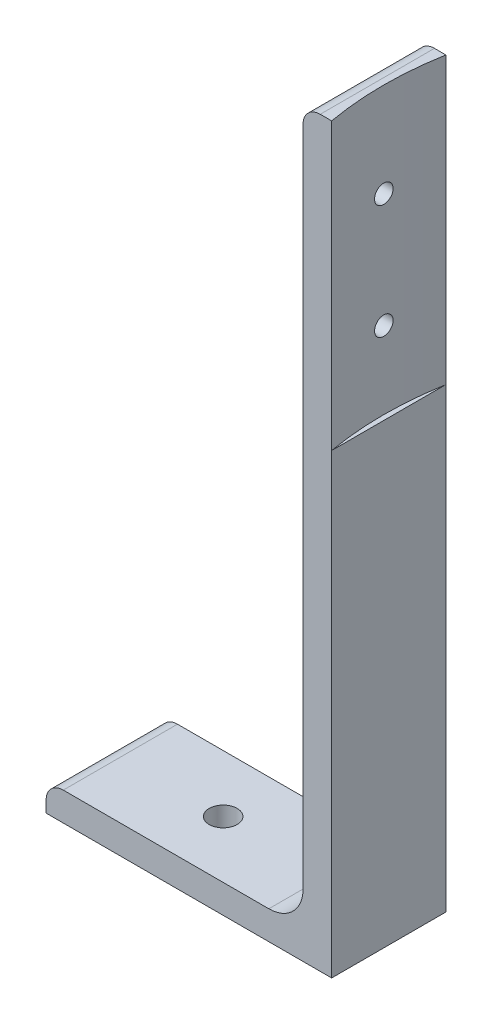
ISO-10303-21;
HEADER;
FILE_DESCRIPTION(('STEP AP214'),'2;1');
FILE_NAME('part.step','',(''),(''),'','','');
FILE_SCHEMA(('AUTOMOTIVE_DESIGN { 1 0 10303 214 1 1 1 1 }'));
ENDSEC;
DATA;
#1=APPLICATION_CONTEXT('core data for automotive mechanical design processes');
#2=APPLICATION_PROTOCOL_DEFINITION('international standard','automotive_design',2000,#1);
#3=PRODUCT_CONTEXT('',#1,'mechanical');
#4=PRODUCT('Part','Part','',(#3));
#5=PRODUCT_RELATED_PRODUCT_CATEGORY('part','',(#4));
#6=PRODUCT_DEFINITION_FORMATION('','',#4);
#7=PRODUCT_DEFINITION_CONTEXT('part definition',#1,'design');
#8=PRODUCT_DEFINITION('design','',#6,#7);
#9=PRODUCT_DEFINITION_SHAPE('','',#8);
#10=(LENGTH_UNIT() NAMED_UNIT(*) SI_UNIT(.MILLI.,.METRE.));
#11=(NAMED_UNIT(*) PLANE_ANGLE_UNIT() SI_UNIT($,.RADIAN.));
#12=(NAMED_UNIT(*) SI_UNIT($,.STERADIAN.) SOLID_ANGLE_UNIT());
#13=UNCERTAINTY_MEASURE_WITH_UNIT(LENGTH_MEASURE(1.E-05),#10,'distance_accuracy_value','');
#14=(GEOMETRIC_REPRESENTATION_CONTEXT(3) GLOBAL_UNCERTAINTY_ASSIGNED_CONTEXT((#13)) GLOBAL_UNIT_ASSIGNED_CONTEXT((#10,
#11,#12)) REPRESENTATION_CONTEXT('',''));
#15=CARTESIAN_POINT('',(0.,0.,0.));
#16=DIRECTION('',(0.,0.,1.));
#17=DIRECTION('',(1.,0.,0.));
#18=AXIS2_PLACEMENT_3D('',#15,#16,#17);
#19=CARTESIAN_POINT('',(0.,0.,10.));
#20=DIRECTION('',(-1.,0.,0.));
#21=DIRECTION('',(0.,0.,1.));
#22=AXIS2_PLACEMENT_3D('',#19,#20,#21);
#23=PLANE('',#22);
#24=DIRECTION('',(0.,0.,-1.));
#25=VECTOR('',#24,1.);
#26=CARTESIAN_POINT('',(0.,80.,0.));
#27=LINE('',#26,#25);
#28=CARTESIAN_POINT('',(0.,80.,10.));
#29=VERTEX_POINT('',#28);
#30=CARTESIAN_POINT('',(0.,80.,-10.));
#31=VERTEX_POINT('',#30);
#32=EDGE_CURVE('E310',#29,#31,#27,.T.);
#33=ORIENTED_EDGE('',*,*,#32,.F.);
#34=DIRECTION('',(0.,1.,0.));
#35=VECTOR('',#34,1.);
#36=CARTESIAN_POINT('',(0.,0.,10.));
#37=LINE('',#36,#35);
#38=CARTESIAN_POINT('',(0.,0.,10.));
#39=VERTEX_POINT('',#38);
#40=EDGE_CURVE('E158',#39,#29,#37,.T.);
#41=ORIENTED_EDGE('',*,*,#40,.F.);
#42=DIRECTION('',(0.,0.,-1.));
#43=VECTOR('',#42,1.);
#44=CARTESIAN_POINT('',(0.,0.,10.));
#45=LINE('',#44,#43);
#46=CARTESIAN_POINT('',(0.,0.,-10.));
#47=VERTEX_POINT('',#46);
#48=EDGE_CURVE('E152',#39,#47,#45,.T.);
#49=ORIENTED_EDGE('',*,*,#48,.T.);
#50=DIRECTION('',(0.,1.,0.));
#51=VECTOR('',#50,1.);
#52=CARTESIAN_POINT('',(0.,0.,-10.));
#53=LINE('',#52,#51);
#54=EDGE_CURVE('E189',#47,#31,#53,.T.);
#55=ORIENTED_EDGE('',*,*,#54,.T.);
#56=EDGE_LOOP('',(#33,#41,#49,#55));
#57=FACE_BOUND('',#56,.T.);
#58=ADVANCED_FACE('F39',(#57),#23,.F.);
#59=CARTESIAN_POINT('',(-2.,127.,10.));
#60=DIRECTION('',(0.,0.,-1.));
#61=DIRECTION('',(-1.,0.,0.));
#62=AXIS2_PLACEMENT_3D('',#59,#60,#61);
#63=CYLINDRICAL_SURFACE('',#62,3.);
#64=CARTESIAN_POINT('',(-2.,127.,-10.));
#65=DIRECTION('',(0.,0.,1.));
#66=DIRECTION('',(1.,0.,0.));
#67=AXIS2_PLACEMENT_3D('',#64,#65,#66);
#68=CIRCLE('',#67,3.);
#69=CARTESIAN_POINT('',(-2.,130.,-10.));
#70=VERTEX_POINT('',#69);
#71=CARTESIAN_POINT('',(-5.,127.,-10.));
#72=VERTEX_POINT('',#71);
#73=EDGE_CURVE('E167',#70,#72,#68,.T.);
#74=ORIENTED_EDGE('',*,*,#73,.T.);
#75=DIRECTION('',(0.,0.,-1.));
#76=VECTOR('',#75,1.);
#77=CARTESIAN_POINT('',(-5.,127.,10.));
#78=LINE('',#77,#76);
#79=CARTESIAN_POINT('',(-5.,127.,10.));
#80=VERTEX_POINT('',#79);
#81=EDGE_CURVE('E11',#80,#72,#78,.T.);
#82=ORIENTED_EDGE('',*,*,#81,.F.);
#83=CARTESIAN_POINT('',(-2.,127.,10.));
#84=DIRECTION('',(0.,0.,1.));
#85=DIRECTION('',(1.,0.,0.));
#86=AXIS2_PLACEMENT_3D('',#83,#84,#85);
#87=CIRCLE('',#86,3.);
#88=CARTESIAN_POINT('',(-2.,130.,10.));
#89=VERTEX_POINT('',#88);
#90=EDGE_CURVE('E195',#89,#80,#87,.T.);
#91=ORIENTED_EDGE('',*,*,#90,.F.);
#92=DIRECTION('',(0.,0.,-1.));
#93=VECTOR('',#92,1.);
#94=CARTESIAN_POINT('',(-2.,130.,10.));
#95=LINE('',#94,#93);
#96=EDGE_CURVE('E166',#89,#70,#95,.T.);
#97=ORIENTED_EDGE('',*,*,#96,.T.);
#98=EDGE_LOOP('',(#74,#82,#91,#97));
#99=FACE_BOUND('',#98,.T.);
#100=ADVANCED_FACE('F41',(#99),#63,.T.);
#101=CARTESIAN_POINT('',(-5.,127.,10.));
#102=DIRECTION('',(1.,0.,0.));
#103=DIRECTION('',(0.,1.,0.));
#104=AXIS2_PLACEMENT_3D('',#101,#102,#103);
#105=PLANE('',#104);
#106=CARTESIAN_POINT('',(-4.99999999999999,93.5,0.));
#107=DIRECTION('',(-1.,0.,0.));
#108=DIRECTION('',(0.,-1.,0.));
#109=AXIS2_PLACEMENT_3D('',#106,#107,#108);
#110=CIRCLE('',#109,1.625);
#111=CARTESIAN_POINT('',(-4.99999999999999,91.875,0.));
#112=VERTEX_POINT('',#111);
#113=EDGE_CURVE('E219',#112,#112,#110,.T.);
#114=ORIENTED_EDGE('',*,*,#113,.F.);
#115=EDGE_LOOP('',(#114));
#116=FACE_BOUND('',#115,.T.);
#117=CARTESIAN_POINT('',(-5.,113.5,0.));
#118=DIRECTION('',(-1.,0.,0.));
#119=DIRECTION('',(0.,-1.,0.));
#120=AXIS2_PLACEMENT_3D('',#117,#118,#119);
#121=CIRCLE('',#120,1.625);
#122=CARTESIAN_POINT('',(-5.,111.875,0.));
#123=VERTEX_POINT('',#122);
#124=EDGE_CURVE('E277',#123,#123,#121,.T.);
#125=ORIENTED_EDGE('',*,*,#124,.F.);
#126=EDGE_LOOP('',(#125));
#127=FACE_BOUND('',#126,.T.);
#128=DIRECTION('',(0.,-1.,0.));
#129=VECTOR('',#128,1.);
#130=CARTESIAN_POINT('',(-5.,127.,-10.));
#131=LINE('',#130,#129);
#132=CARTESIAN_POINT('',(-4.99999999999999,11.,-10.));
#133=VERTEX_POINT('',#132);
#134=EDGE_CURVE('E171',#72,#133,#131,.T.);
#135=ORIENTED_EDGE('',*,*,#134,.T.);
#136=DIRECTION('',(0.,0.,-1.));
#137=VECTOR('',#136,1.);
#138=CARTESIAN_POINT('',(-4.99999999999999,11.,10.));
#139=LINE('',#138,#137);
#140=CARTESIAN_POINT('',(-4.99999999999999,11.,10.));
#141=VERTEX_POINT('',#140);
#142=EDGE_CURVE('E54',#141,#133,#139,.T.);
#143=ORIENTED_EDGE('',*,*,#142,.F.);
#144=DIRECTION('',(0.,-1.,0.));
#145=VECTOR('',#144,1.);
#146=CARTESIAN_POINT('',(-5.,127.,10.));
#147=LINE('',#146,#145);
#148=EDGE_CURVE('E113',#80,#141,#147,.T.);
#149=ORIENTED_EDGE('',*,*,#148,.F.);
#150=ORIENTED_EDGE('',*,*,#81,.T.);
#151=EDGE_LOOP('',(#135,#143,#149,#150));
#152=FACE_BOUND('',#151,.T.);
#153=ADVANCED_FACE('F245',(#116,#127,#152),#105,.F.);
#154=CARTESIAN_POINT('',(-11.,11.,10.));
#155=DIRECTION('',(0.,0.,-1.));
#156=DIRECTION('',(-1.,0.,0.));
#157=AXIS2_PLACEMENT_3D('',#154,#155,#156);
#158=CYLINDRICAL_SURFACE('',#157,6.);
#159=CARTESIAN_POINT('',(-11.,11.,-10.));
#160=DIRECTION('',(0.,0.,-1.));
#161=DIRECTION('',(-1.,0.,0.));
#162=AXIS2_PLACEMENT_3D('',#159,#160,#161);
#163=CIRCLE('',#162,6.);
#164=CARTESIAN_POINT('',(-11.,5.,-10.));
#165=VERTEX_POINT('',#164);
#166=EDGE_CURVE('E175',#133,#165,#163,.T.);
#167=ORIENTED_EDGE('',*,*,#166,.T.);
#168=DIRECTION('',(0.,0.,-1.));
#169=VECTOR('',#168,1.);
#170=CARTESIAN_POINT('',(-11.,5.,10.));
#171=LINE('',#170,#169);
#172=CARTESIAN_POINT('',(-11.,5.,10.));
#173=VERTEX_POINT('',#172);
#174=EDGE_CURVE('E206',#173,#165,#171,.T.);
#175=ORIENTED_EDGE('',*,*,#174,.F.);
#176=CARTESIAN_POINT('',(-11.,11.,10.));
#177=DIRECTION('',(0.,0.,-1.));
#178=DIRECTION('',(-1.,0.,0.));
#179=AXIS2_PLACEMENT_3D('',#176,#177,#178);
#180=CIRCLE('',#179,6.);
#181=EDGE_CURVE('E284',#141,#173,#180,.T.);
#182=ORIENTED_EDGE('',*,*,#181,.F.);
#183=ORIENTED_EDGE('',*,*,#142,.T.);
#184=EDGE_LOOP('',(#167,#175,#182,#183));
#185=FACE_BOUND('',#184,.T.);
#186=ADVANCED_FACE('F264',(#185),#158,.F.);
#187=CARTESIAN_POINT('',(-11.,5.,10.));
#188=DIRECTION('',(0.,-1.,0.));
#189=DIRECTION('',(1.,0.,0.));
#190=AXIS2_PLACEMENT_3D('',#187,#188,#189);
#191=PLANE('',#190);
#192=CARTESIAN_POINT('',(-29.,5.,0.));
#193=DIRECTION('',(0.,1.,0.));
#194=DIRECTION('',(-1.,0.,0.));
#195=AXIS2_PLACEMENT_3D('',#192,#193,#194);
#196=CIRCLE('',#195,2.45);
#197=CARTESIAN_POINT('',(-31.45,5.,0.));
#198=VERTEX_POINT('',#197);
#199=EDGE_CURVE('E320',#198,#198,#196,.T.);
#200=ORIENTED_EDGE('',*,*,#199,.F.);
#201=EDGE_LOOP('',(#200));
#202=FACE_BOUND('',#201,.T.);
#203=DIRECTION('',(-1.,0.,0.));
#204=VECTOR('',#203,1.);
#205=CARTESIAN_POINT('',(-11.,5.,-10.));
#206=LINE('',#205,#204);
#207=CARTESIAN_POINT('',(-47.,5.,-10.));
#208=VERTEX_POINT('',#207);
#209=EDGE_CURVE('E178',#165,#208,#206,.T.);
#210=ORIENTED_EDGE('',*,*,#209,.T.);
#211=DIRECTION('',(0.,0.,-1.));
#212=VECTOR('',#211,1.);
#213=CARTESIAN_POINT('',(-47.,5.,10.));
#214=LINE('',#213,#212);
#215=CARTESIAN_POINT('',(-47.,5.,10.));
#216=VERTEX_POINT('',#215);
#217=EDGE_CURVE('E202',#216,#208,#214,.T.);
#218=ORIENTED_EDGE('',*,*,#217,.F.);
#219=DIRECTION('',(-1.,0.,0.));
#220=VECTOR('',#219,1.);
#221=CARTESIAN_POINT('',(-11.,5.,10.));
#222=LINE('',#221,#220);
#223=EDGE_CURVE('E291',#173,#216,#222,.T.);
#224=ORIENTED_EDGE('',*,*,#223,.F.);
#225=ORIENTED_EDGE('',*,*,#174,.T.);
#226=EDGE_LOOP('',(#210,#218,#224,#225));
#227=FACE_BOUND('',#226,.T.);
#228=ADVANCED_FACE('F260',(#202,#227),#191,.F.);
#229=CARTESIAN_POINT('',(-47.,1.99999999999999,10.));
#230=DIRECTION('',(0.,0.,-1.));
#231=DIRECTION('',(-1.,0.,0.));
#232=AXIS2_PLACEMENT_3D('',#229,#230,#231);
#233=CYLINDRICAL_SURFACE('',#232,3.);
#234=CARTESIAN_POINT('',(-47.,1.99999999999999,-10.));
#235=DIRECTION('',(0.,0.,1.));
#236=DIRECTION('',(1.,0.,0.));
#237=AXIS2_PLACEMENT_3D('',#234,#235,#236);
#238=CIRCLE('',#237,3.);
#239=CARTESIAN_POINT('',(-50.,1.99999999999999,-10.));
#240=VERTEX_POINT('',#239);
#241=EDGE_CURVE('E181',#208,#240,#238,.T.);
#242=ORIENTED_EDGE('',*,*,#241,.T.);
#243=DIRECTION('',(0.,0.,-1.));
#244=VECTOR('',#243,1.);
#245=CARTESIAN_POINT('',(-50.,1.99999999999999,10.));
#246=LINE('',#245,#244);
#247=CARTESIAN_POINT('',(-50.,1.99999999999999,10.));
#248=VERTEX_POINT('',#247);
#249=EDGE_CURVE('E151',#248,#240,#246,.T.);
#250=ORIENTED_EDGE('',*,*,#249,.F.);
#251=CARTESIAN_POINT('',(-47.,1.99999999999999,10.));
#252=DIRECTION('',(0.,0.,1.));
#253=DIRECTION('',(1.,0.,0.));
#254=AXIS2_PLACEMENT_3D('',#251,#252,#253);
#255=CIRCLE('',#254,3.);
#256=EDGE_CURVE('E137',#216,#248,#255,.T.);
#257=ORIENTED_EDGE('',*,*,#256,.F.);
#258=ORIENTED_EDGE('',*,*,#217,.T.);
#259=EDGE_LOOP('',(#242,#250,#257,#258));
#260=FACE_BOUND('',#259,.T.);
#261=ADVANCED_FACE('F257',(#260),#233,.T.);
#262=CARTESIAN_POINT('',(-50.,1.99999999999999,10.));
#263=DIRECTION('',(1.,0.,0.));
#264=DIRECTION('',(0.,0.,-1.));
#265=AXIS2_PLACEMENT_3D('',#262,#263,#264);
#266=PLANE('',#265);
#267=DIRECTION('',(0.,-1.,0.));
#268=VECTOR('',#267,1.);
#269=CARTESIAN_POINT('',(-50.,1.99999999999999,-10.));
#270=LINE('',#269,#268);
#271=CARTESIAN_POINT('',(-50.,0.,-10.));
#272=VERTEX_POINT('',#271);
#273=EDGE_CURVE('E147',#240,#272,#270,.T.);
#274=ORIENTED_EDGE('',*,*,#273,.T.);
#275=DIRECTION('',(0.,0.,-1.));
#276=VECTOR('',#275,1.);
#277=CARTESIAN_POINT('',(-50.,0.,10.));
#278=LINE('',#277,#276);
#279=CARTESIAN_POINT('',(-50.,0.,10.));
#280=VERTEX_POINT('',#279);
#281=EDGE_CURVE('E144',#280,#272,#278,.T.);
#282=ORIENTED_EDGE('',*,*,#281,.F.);
#283=DIRECTION('',(0.,-1.,0.));
#284=VECTOR('',#283,1.);
#285=CARTESIAN_POINT('',(-50.,1.99999999999999,10.));
#286=LINE('',#285,#284);
#287=EDGE_CURVE('E129',#248,#280,#286,.T.);
#288=ORIENTED_EDGE('',*,*,#287,.F.);
#289=ORIENTED_EDGE('',*,*,#249,.T.);
#290=EDGE_LOOP('',(#274,#282,#288,#289));
#291=FACE_BOUND('',#290,.T.);
#292=ADVANCED_FACE('F145',(#291),#266,.F.);
#293=CARTESIAN_POINT('',(0.,0.,10.));
#294=DIRECTION('',(0.,1.,0.));
#295=DIRECTION('',(-1.,0.,0.));
#296=AXIS2_PLACEMENT_3D('',#293,#294,#295);
#297=PLANE('',#296);
#298=CARTESIAN_POINT('',(-29.,0.,0.));
#299=DIRECTION('',(0.,1.,0.));
#300=DIRECTION('',(-1.,0.,0.));
#301=AXIS2_PLACEMENT_3D('',#298,#299,#300);
#302=CIRCLE('',#301,2.45);
#303=CARTESIAN_POINT('',(-31.45,0.,0.));
#304=VERTEX_POINT('',#303);
#305=EDGE_CURVE('E317',#304,#304,#302,.T.);
#306=ORIENTED_EDGE('',*,*,#305,.T.);
#307=EDGE_LOOP('',(#306));
#308=FACE_BOUND('',#307,.T.);
#309=DIRECTION('',(1.,0.,0.));
#310=VECTOR('',#309,1.);
#311=CARTESIAN_POINT('',(0.,0.,-10.));
#312=LINE('',#311,#310);
#313=EDGE_CURVE('E186',#272,#47,#312,.T.);
#314=ORIENTED_EDGE('',*,*,#313,.T.);
#315=ORIENTED_EDGE('',*,*,#48,.F.);
#316=DIRECTION('',(1.,0.,0.));
#317=VECTOR('',#316,1.);
#318=CARTESIAN_POINT('',(0.,0.,10.));
#319=LINE('',#318,#317);
#320=EDGE_CURVE('E134',#280,#39,#319,.T.);
#321=ORIENTED_EDGE('',*,*,#320,.F.);
#322=ORIENTED_EDGE('',*,*,#281,.T.);
#323=EDGE_LOOP('',(#314,#315,#321,#322));
#324=FACE_BOUND('',#323,.T.);
#325=ADVANCED_FACE('F154',(#308,#324),#297,.F.);
#326=CARTESIAN_POINT('',(-2.,130.,10.));
#327=DIRECTION('',(0.,-1.,0.));
#328=DIRECTION('',(0.,0.,-1.));
#329=AXIS2_PLACEMENT_3D('',#326,#327,#328);
#330=PLANE('',#329);
#331=DIRECTION('',(-1.,0.,0.));
#332=VECTOR('',#331,1.);
#333=CARTESIAN_POINT('',(-2.,130.,10.));
#334=LINE('',#333,#332);
#335=CARTESIAN_POINT('',(0.,130.,10.));
#336=VERTEX_POINT('',#335);
#337=EDGE_CURVE('E71',#336,#89,#334,.T.);
#338=ORIENTED_EDGE('',*,*,#337,.F.);
#339=CARTESIAN_POINT('',(56.1159513863928,130.,0.));
#340=DIRECTION('',(0.,1.,0.));
#341=DIRECTION('',(0.,0.,1.));
#342=AXIS2_PLACEMENT_3D('',#339,#340,#341);
#343=CIRCLE('',#342,57.);
#344=CARTESIAN_POINT('',(0.,130.,-10.));
#345=VERTEX_POINT('',#344);
#346=EDGE_CURVE('E306',#345,#336,#343,.T.);
#347=ORIENTED_EDGE('',*,*,#346,.F.);
#348=DIRECTION('',(-1.,0.,0.));
#349=VECTOR('',#348,1.);
#350=CARTESIAN_POINT('',(-2.,130.,-10.));
#351=LINE('',#350,#349);
#352=EDGE_CURVE('E105',#345,#70,#351,.T.);
#353=ORIENTED_EDGE('',*,*,#352,.T.);
#354=ORIENTED_EDGE('',*,*,#96,.F.);
#355=EDGE_LOOP('',(#338,#347,#353,#354));
#356=FACE_BOUND('',#355,.T.);
#357=ADVANCED_FACE('F250',(#356),#330,.F.);
#358=CARTESIAN_POINT('',(-2.,127.,10.));
#359=DIRECTION('',(0.,0.,1.));
#360=DIRECTION('',(1.,0.,0.));
#361=AXIS2_PLACEMENT_3D('',#358,#359,#360);
#362=PLANE('',#361);
#363=ORIENTED_EDGE('',*,*,#90,.T.);
#364=ORIENTED_EDGE('',*,*,#148,.T.);
#365=ORIENTED_EDGE('',*,*,#181,.T.);
#366=ORIENTED_EDGE('',*,*,#223,.T.);
#367=ORIENTED_EDGE('',*,*,#256,.T.);
#368=ORIENTED_EDGE('',*,*,#287,.T.);
#369=ORIENTED_EDGE('',*,*,#320,.T.);
#370=ORIENTED_EDGE('',*,*,#40,.T.);
#371=DIRECTION('',(0.,1.,0.));
#372=VECTOR('',#371,1.);
#373=CARTESIAN_POINT('',(0.,80.,10.));
#374=LINE('',#373,#372);
#375=EDGE_CURVE('E172',#29,#336,#374,.T.);
#376=ORIENTED_EDGE('',*,*,#375,.T.);
#377=ORIENTED_EDGE('',*,*,#337,.T.);
#378=EDGE_LOOP('',(#363,#364,#365,#366,#367,#368,#369,#370,#376,#377));
#379=FACE_BOUND('',#378,.T.);
#380=ADVANCED_FACE('F131',(#379),#362,.T.);
#381=CARTESIAN_POINT('',(-2.,127.,-10.));
#382=DIRECTION('',(0.,0.,1.));
#383=DIRECTION('',(1.,0.,0.));
#384=AXIS2_PLACEMENT_3D('',#381,#382,#383);
#385=PLANE('',#384);
#386=ORIENTED_EDGE('',*,*,#73,.F.);
#387=ORIENTED_EDGE('',*,*,#352,.F.);
#388=DIRECTION('',(0.,1.,0.));
#389=VECTOR('',#388,1.);
#390=CARTESIAN_POINT('',(0.,80.,-10.));
#391=LINE('',#390,#389);
#392=EDGE_CURVE('E301',#31,#345,#391,.T.);
#393=ORIENTED_EDGE('',*,*,#392,.F.);
#394=ORIENTED_EDGE('',*,*,#54,.F.);
#395=ORIENTED_EDGE('',*,*,#313,.F.);
#396=ORIENTED_EDGE('',*,*,#273,.F.);
#397=ORIENTED_EDGE('',*,*,#241,.F.);
#398=ORIENTED_EDGE('',*,*,#209,.F.);
#399=ORIENTED_EDGE('',*,*,#166,.F.);
#400=ORIENTED_EDGE('',*,*,#134,.F.);
#401=EDGE_LOOP('',(#386,#387,#393,#394,#395,#396,#397,#398,#399,#400));
#402=FACE_BOUND('',#401,.T.);
#403=ADVANCED_FACE('F237',(#402),#385,.F.);
#404=CARTESIAN_POINT('',(56.1159513863928,80.,0.));
#405=DIRECTION('',(0.,1.,0.));
#406=DIRECTION('',(0.,0.,1.));
#407=AXIS2_PLACEMENT_3D('',#404,#405,#406);
#408=CYLINDRICAL_SURFACE('',#407,57.);
#409=CARTESIAN_POINT('',(-0.884048613607205,91.875,0.));
#410=CARTESIAN_POINT('',(-0.884048301419244,91.8750040407851,0.0912570705500619));
#411=CARTESIAN_POINT('',(-0.883827108364941,91.8827130510623,0.182579839011391));
#412=CARTESIAN_POINT('',(-0.882965989506306,91.9133580817059,0.362708935005013));
#413=CARTESIAN_POINT('',(-0.88232556316476,91.93631230434,0.451512121922383));
#414=CARTESIAN_POINT('',(-0.880698506544359,91.9967925506374,0.623966457629173));
#415=CARTESIAN_POINT('',(-0.879712045260624,92.03431146221,0.707620097932997));
#416=CARTESIAN_POINT('',(-0.877504198818861,92.122845903173,0.867418236400548));
#417=CARTESIAN_POINT('',(-0.876282871132212,92.1738581319176,0.943564564708674));
#418=CARTESIAN_POINT('',(-0.873742237223969,92.2879567890859,1.08624244717693));
#419=CARTESIAN_POINT('',(-0.872422896051672,92.3510475373679,1.15277054640994));
#420=CARTESIAN_POINT('',(-0.869835242310035,92.487504940964,1.27429447354724));
#421=CARTESIAN_POINT('',(-0.868566931771846,92.5608720047822,1.32928984278529));
#422=CARTESIAN_POINT('',(-0.866224200511634,92.7158115271648,1.42619202997452));
#423=CARTESIAN_POINT('',(-0.865149809253497,92.7973852297096,1.46809685966885));
#424=CARTESIAN_POINT('',(-0.863316377658713,92.9664135646253,1.53761546507425));
#425=CARTESIAN_POINT('',(-0.862557336118333,93.0538681745465,1.56522929533611));
#426=CARTESIAN_POINT('',(-0.861440437415242,93.2321505052766,1.60537485451699));
#427=CARTESIAN_POINT('',(-0.861082470564122,93.3229772968164,1.61791070712445));
#428=CARTESIAN_POINT('',(-0.860807753271562,93.5054467623545,1.62755716307993));
#429=CARTESIAN_POINT('',(-0.860891001162523,93.5970894332678,1.62466782472849));
#430=CARTESIAN_POINT('',(-0.861489223482446,93.7785612792106,1.60354941438371));
#431=CARTESIAN_POINT('',(-0.86200407236305,93.8683909738356,1.5853248032602));
#432=CARTESIAN_POINT('',(-0.86340725970101,94.0437153684787,1.53406007525515));
#433=CARTESIAN_POINT('',(-0.864295598939145,94.1292100594341,1.50101992740184));
#434=CARTESIAN_POINT('',(-0.866345768980347,94.2934518908058,1.42105689833791));
#435=CARTESIAN_POINT('',(-0.867507640064752,94.3721980350735,1.37413197214041));
#436=CARTESIAN_POINT('',(-0.869973852324642,94.5206965142471,1.26773294211103));
#437=CARTESIAN_POINT('',(-0.871278193788508,94.5904488309476,1.20825881287757));
#438=CARTESIAN_POINT('',(-0.873882866099718,94.7190056338839,1.07842439122159));
#439=CARTESIAN_POINT('',(-0.875183195353381,94.7778062125266,1.0080602295557));
#440=CARTESIAN_POINT('',(-0.877632806960904,94.8827603125688,0.858456784977403));
#441=CARTESIAN_POINT('',(-0.878782089290813,94.9289138319628,0.779217500657651));
#442=CARTESIAN_POINT('',(-0.880800064456523,95.0072632328819,0.614110976005348));
#443=CARTESIAN_POINT('',(-0.88166875483895,95.0394589923672,0.528243677728453));
#444=CARTESIAN_POINT('',(-0.883027581099235,95.0889764559222,0.352319577175232));
#445=CARTESIAN_POINT('',(-0.883517717909278,95.106298196619,0.262262785216087));
#446=CARTESIAN_POINT('',(-0.884064066741103,95.1255711323636,0.0805500520662809));
#447=CARTESIAN_POINT('',(-0.884120431395588,95.1275277339938,-0.011105315249858));
#448=CARTESIAN_POINT('',(-0.883793286413652,95.1160289387422,-0.193443238277225));
#449=CARTESIAN_POINT('',(-0.88340977723559,95.1025735579202,-0.284125795002048));
#450=CARTESIAN_POINT('',(-0.882246206498614,95.0606372234982,-0.461928862868564));
#451=CARTESIAN_POINT('',(-0.881466209705213,95.0321587238681,-0.549049953258776));
#452=CARTESIAN_POINT('',(-0.879597562012541,94.9609870484448,-0.717274801962333));
#453=CARTESIAN_POINT('',(-0.878508910557204,94.9182938470427,-0.798378549434595));
#454=CARTESIAN_POINT('',(-0.876145221034166,94.8198907540791,-0.952291348299664));
#455=CARTESIAN_POINT('',(-0.874870130894296,94.7641772233409,-1.02509807219871));
#456=CARTESIAN_POINT('',(-0.872277445287141,94.641320323247,-1.16032672709317));
#457=CARTESIAN_POINT('',(-0.870959849720132,94.5741769270734,-1.22274863372209));
#458=CARTESIAN_POINT('',(-0.868430256585682,94.4303430968685,-1.33545375746673));
#459=CARTESIAN_POINT('',(-0.867218289431239,94.3536499285608,-1.38573348588391));
#460=CARTESIAN_POINT('',(-0.86503707585264,94.192907574147,-1.47270313066339));
#461=CARTESIAN_POINT('',(-0.864067828909792,94.1088584037612,-1.50939307606707));
#462=CARTESIAN_POINT('',(-0.862481553163349,93.9358030405942,-1.56813555367483));
#463=CARTESIAN_POINT('',(-0.861864469987987,93.8467976153563,-1.59019034553585));
#464=CARTESIAN_POINT('',(-0.861051943400036,93.6663453866337,-1.61904387145562));
#465=CARTESIAN_POINT('',(-0.860856499726194,93.5748985846618,-1.62584261496715));
#466=CARTESIAN_POINT('',(-0.860909307618281,93.3921944102099,-1.62399078538627));
#467=CARTESIAN_POINT('',(-0.861157401076712,93.3009369818332,-1.61534571754374));
#468=CARTESIAN_POINT('',(-0.862068982868488,93.1211693287558,-1.58286298167196));
#469=CARTESIAN_POINT('',(-0.86273247202662,93.0326591095103,-1.55902528347704));
#470=CARTESIAN_POINT('',(-0.864400026919312,92.860896104712,-1.49683465049082));
#471=CARTESIAN_POINT('',(-0.8654040984413,92.7776434085275,-1.45848146904038));
#472=CARTESIAN_POINT('',(-0.867639582750199,92.6187605565862,-1.36835063720778));
#473=CARTESIAN_POINT('',(-0.868870987247036,92.5431301230264,-1.31657347632544));
#474=CARTESIAN_POINT('',(-0.871422751668813,92.4016137598144,-1.20104887295966));
#475=CARTESIAN_POINT('',(-0.872743133750872,92.3357302704864,-1.13729844178749));
#476=CARTESIAN_POINT('',(-0.875324115852912,92.2155830795976,-0.999623103418122));
#477=CARTESIAN_POINT('',(-0.876584700983665,92.1613222603392,-0.925695679881101));
#478=CARTESIAN_POINT('',(-0.87890440020436,92.065952322061,-0.769737529256052));
#479=CARTESIAN_POINT('',(-0.87996338654307,92.024851531252,-0.687701713642046));
#480=CARTESIAN_POINT('',(-0.881758194250723,91.9570541651337,-0.517954459568831));
#481=CARTESIAN_POINT('',(-0.882494400987531,91.9303404043373,-0.43024993341061));
#482=CARTESIAN_POINT('',(-0.883363822236891,91.8991587086527,-0.284992427938202));
#483=CARTESIAN_POINT('',(-0.883619505545784,91.8901105832309,-0.228382386363382));
#484=CARTESIAN_POINT('',(-0.883961999176128,91.8780299616655,-0.114523522680112));
#485=CARTESIAN_POINT('',(-0.884048809542402,91.8749974639252,-0.0572747007412097));
#486=CARTESIAN_POINT('',(-0.884048613607205,91.875,0.));
#487=B_SPLINE_CURVE_WITH_KNOTS('',3,(#409,#410,#411,#412,#413,#414,#415,#416,#417,#418,#419,
#420,#421,#422,#423,#424,#425,#426,#427,#428,#429,#430,#431,#432,#433,#434,#435,#436,#437,#438,
#439,#440,#441,#442,#443,#444,#445,#446,#447,#448,#449,#450,#451,#452,#453,#454,#455,#456,#457,
#458,#459,#460,#461,#462,#463,#464,#465,#466,#467,#468,#469,#470,#471,#472,#473,#474,#475,#476,
#477,#478,#479,#480,#481,#482,#483,#484,#485,#486),.UNSPECIFIED.,.T.,.F.,(4,2,2,2,2,2,2,2,2,2,2,
2,2,2,2,2,2,2,2,2,2,2,2,2,2,2,2,2,2,2,2,2,2,2,2,2,2,2,4),(0.,0.273562152282933,
0.547451517110849,0.821207306778998,1.09489619394832,1.36868314888286,1.64248099048765,
1.91632039768628,2.19015875959288,2.46392221218056,2.73768463006179,3.01136744084857,
3.28505082376988,3.5587745355846,3.83249880146477,4.10632054616977,4.38014233429538,
4.65396651653501,4.92779002448199,5.20151717692569,5.47524404413869,5.74892621294011,
6.02260887480617,6.29636812254301,6.5701280126078,6.8439664662073,7.11780433461021,
7.39159991280411,7.6653953213518,7.93909314962329,8.21279152133629,8.48649454416818,
8.76018758793712,9.03394904017396,9.30777830402759,9.58178051743494,9.85545470172064,
10.0271476398165,10.1988405323419),.UNSPECIFIED.);
#488=CARTESIAN_POINT('',(-0.884048613607205,91.875,0.));
#489=VERTEX_POINT('',#488);
#490=EDGE_CURVE('E43',#489,#489,#487,.T.);
#491=ORIENTED_EDGE('',*,*,#490,.T.);
#492=EDGE_LOOP('',(#491));
#493=FACE_BOUND('',#492,.T.);
#494=CARTESIAN_POINT('',(-0.884048613607205,111.875,0.));
#495=CARTESIAN_POINT('',(-0.884048301419244,111.875004040785,0.0912570705500619));
#496=CARTESIAN_POINT('',(-0.883827108364941,111.882713051062,0.182579839011391));
#497=CARTESIAN_POINT('',(-0.882965989506306,111.913358081706,0.362708935005013));
#498=CARTESIAN_POINT('',(-0.88232556316476,111.93631230434,0.451512121922383));
#499=CARTESIAN_POINT('',(-0.880698506544359,111.996792550637,0.623966457629173));
#500=CARTESIAN_POINT('',(-0.879712045260624,112.03431146221,0.707620097932997));
#501=CARTESIAN_POINT('',(-0.877504198818861,112.122845903173,0.867418236400548));
#502=CARTESIAN_POINT('',(-0.876282871132212,112.173858131918,0.943564564708674));
#503=CARTESIAN_POINT('',(-0.873742237223969,112.287956789086,1.08624244717693));
#504=CARTESIAN_POINT('',(-0.872422896051672,112.351047537368,1.15277054640994));
#505=CARTESIAN_POINT('',(-0.869835242310035,112.487504940964,1.27429447354724));
#506=CARTESIAN_POINT('',(-0.868566931771846,112.560872004782,1.32928984278529));
#507=CARTESIAN_POINT('',(-0.866224200511634,112.715811527165,1.42619202997451));
#508=CARTESIAN_POINT('',(-0.865149809253497,112.79738522971,1.46809685966885));
#509=CARTESIAN_POINT('',(-0.863316377658713,112.966413564625,1.53761546507425));
#510=CARTESIAN_POINT('',(-0.862557336118333,113.053868174546,1.56522929533611));
#511=CARTESIAN_POINT('',(-0.861440437415242,113.232150505277,1.60537485451699));
#512=CARTESIAN_POINT('',(-0.861082470564122,113.322977296816,1.61791070712445));
#513=CARTESIAN_POINT('',(-0.860807753271562,113.505446762355,1.62755716307993));
#514=CARTESIAN_POINT('',(-0.860891001162523,113.597089433268,1.62466782472849));
#515=CARTESIAN_POINT('',(-0.861489223482446,113.778561279211,1.60354941438371));
#516=CARTESIAN_POINT('',(-0.86200407236305,113.868390973836,1.5853248032602));
#517=CARTESIAN_POINT('',(-0.86340725970101,114.043715368479,1.53406007525515));
#518=CARTESIAN_POINT('',(-0.864295598939145,114.129210059434,1.50101992740184));
#519=CARTESIAN_POINT('',(-0.866345768980347,114.293451890806,1.42105689833791));
#520=CARTESIAN_POINT('',(-0.867507640064752,114.372198035073,1.37413197214041));
#521=CARTESIAN_POINT('',(-0.869973852324642,114.520696514247,1.26773294211103));
#522=CARTESIAN_POINT('',(-0.871278193788508,114.590448830948,1.20825881287757));
#523=CARTESIAN_POINT('',(-0.873882866099718,114.719005633884,1.07842439122159));
#524=CARTESIAN_POINT('',(-0.875183195353381,114.777806212527,1.0080602295557));
#525=CARTESIAN_POINT('',(-0.877632806960904,114.882760312569,0.858456784977403));
#526=CARTESIAN_POINT('',(-0.878782089290813,114.928913831963,0.779217500657651));
#527=CARTESIAN_POINT('',(-0.880800064456523,115.007263232882,0.614110976005348));
#528=CARTESIAN_POINT('',(-0.88166875483895,115.039458992367,0.528243677728453));
#529=CARTESIAN_POINT('',(-0.883027581099235,115.088976455922,0.352319577175232));
#530=CARTESIAN_POINT('',(-0.883517717909278,115.106298196619,0.262262785216087));
#531=CARTESIAN_POINT('',(-0.884064066741103,115.125571132364,0.0805500520662812));
#532=CARTESIAN_POINT('',(-0.884120431395588,115.127527733994,-0.0111053152498574));
#533=CARTESIAN_POINT('',(-0.883793286413652,115.116028938742,-0.193443238277224));
#534=CARTESIAN_POINT('',(-0.88340977723559,115.10257355792,-0.284125795002047));
#535=CARTESIAN_POINT('',(-0.882246206498614,115.060637223498,-0.461928862868564));
#536=CARTESIAN_POINT('',(-0.881466209705213,115.032158723868,-0.549049953258776));
#537=CARTESIAN_POINT('',(-0.879597562012541,114.960987048445,-0.717274801962333));
#538=CARTESIAN_POINT('',(-0.878508910557204,114.918293847043,-0.798378549434595));
#539=CARTESIAN_POINT('',(-0.876145221034166,114.819890754079,-0.952291348299664));
#540=CARTESIAN_POINT('',(-0.874870130894296,114.764177223341,-1.02509807219871));
#541=CARTESIAN_POINT('',(-0.872277445287141,114.641320323247,-1.16032672709317));
#542=CARTESIAN_POINT('',(-0.870959849720132,114.574176927073,-1.22274863372209));
#543=CARTESIAN_POINT('',(-0.868430256585682,114.430343096869,-1.33545375746673));
#544=CARTESIAN_POINT('',(-0.867218289431239,114.353649928561,-1.38573348588392));
#545=CARTESIAN_POINT('',(-0.86503707585264,114.192907574147,-1.47270313066339));
#546=CARTESIAN_POINT('',(-0.864067828909792,114.108858403761,-1.50939307606707));
#547=CARTESIAN_POINT('',(-0.862481553163349,113.935803040594,-1.56813555367483));
#548=CARTESIAN_POINT('',(-0.861864469987987,113.846797615356,-1.59019034553585));
#549=CARTESIAN_POINT('',(-0.861051943400036,113.666345386634,-1.61904387145562));
#550=CARTESIAN_POINT('',(-0.860856499726194,113.574898584662,-1.62584261496715));
#551=CARTESIAN_POINT('',(-0.860909307618281,113.39219441021,-1.62399078538627));
#552=CARTESIAN_POINT('',(-0.861157401076712,113.300936981833,-1.61534571754374));
#553=CARTESIAN_POINT('',(-0.862068982868488,113.121169328756,-1.58286298167196));
#554=CARTESIAN_POINT('',(-0.86273247202662,113.03265910951,-1.55902528347704));
#555=CARTESIAN_POINT('',(-0.864400026919312,112.860896104712,-1.49683465049082));
#556=CARTESIAN_POINT('',(-0.8654040984413,112.777643408527,-1.45848146904038));
#557=CARTESIAN_POINT('',(-0.867639582750199,112.618760556586,-1.36835063720778));
#558=CARTESIAN_POINT('',(-0.868870987247036,112.543130123026,-1.31657347632544));
#559=CARTESIAN_POINT('',(-0.871422751668813,112.401613759814,-1.20104887295966));
#560=CARTESIAN_POINT('',(-0.872743133750872,112.335730270486,-1.13729844178749));
#561=CARTESIAN_POINT('',(-0.875324115852912,112.215583079598,-0.999623103418122));
#562=CARTESIAN_POINT('',(-0.876584700983665,112.161322260339,-0.925695679881101));
#563=CARTESIAN_POINT('',(-0.87890440020436,112.065952322061,-0.769737529256052));
#564=CARTESIAN_POINT('',(-0.87996338654307,112.024851531252,-0.687701713642046));
#565=CARTESIAN_POINT('',(-0.881758194250723,111.957054165134,-0.517954459568831));
#566=CARTESIAN_POINT('',(-0.882494400987531,111.930340404337,-0.43024993341061));
#567=CARTESIAN_POINT('',(-0.883363822236891,111.899158708653,-0.284992427938202));
#568=CARTESIAN_POINT('',(-0.883619505545784,111.890110583231,-0.228382386363382));
#569=CARTESIAN_POINT('',(-0.883961999176128,111.878029961665,-0.114523522680112));
#570=CARTESIAN_POINT('',(-0.884048809542402,111.874997463925,-0.0572747007412097));
#571=CARTESIAN_POINT('',(-0.884048613607205,111.875,0.));
#572=B_SPLINE_CURVE_WITH_KNOTS('',3,(#494,#495,#496,#497,#498,#499,#500,#501,#502,#503,#504,
#505,#506,#507,#508,#509,#510,#511,#512,#513,#514,#515,#516,#517,#518,#519,#520,#521,#522,#523,
#524,#525,#526,#527,#528,#529,#530,#531,#532,#533,#534,#535,#536,#537,#538,#539,#540,#541,#542,
#543,#544,#545,#546,#547,#548,#549,#550,#551,#552,#553,#554,#555,#556,#557,#558,#559,#560,#561,
#562,#563,#564,#565,#566,#567,#568,#569,#570,#571),.UNSPECIFIED.,.T.,.F.,(4,2,2,2,2,2,2,2,2,2,2,
2,2,2,2,2,2,2,2,2,2,2,2,2,2,2,2,2,2,2,2,2,2,2,2,2,2,2,4),(0.,0.273562152282933,
0.547451517110849,0.821207306778998,1.09489619394832,1.36868314888286,1.64248099048765,
1.91632039768628,2.19015875959288,2.46392221218056,2.73768463006179,3.01136744084857,
3.28505082376988,3.5587745355846,3.83249880146476,4.10632054616977,4.38014233429538,
4.65396651653501,4.92779002448199,5.20151717692569,5.47524404413869,5.74892621294011,
6.02260887480617,6.29636812254301,6.57012801260779,6.84396646620731,7.11780433461021,
7.39159991280411,7.6653953213518,7.93909314962329,8.21279152133629,8.48649454416818,
8.76018758793712,9.03394904017396,9.30777830402759,9.58178051743494,9.85545470172064,
10.0271476398165,10.1988405323419),.UNSPECIFIED.);
#573=CARTESIAN_POINT('',(-0.884048613607205,111.875,0.));
#574=VERTEX_POINT('',#573);
#575=EDGE_CURVE('E212',#574,#574,#572,.T.);
#576=ORIENTED_EDGE('',*,*,#575,.T.);
#577=EDGE_LOOP('',(#576));
#578=FACE_BOUND('',#577,.T.);
#579=ORIENTED_EDGE('',*,*,#346,.T.);
#580=ORIENTED_EDGE('',*,*,#375,.F.);
#581=CARTESIAN_POINT('',(56.1159513863928,80.,0.));
#582=DIRECTION('',(0.,1.,0.));
#583=DIRECTION('',(0.,0.,1.));
#584=AXIS2_PLACEMENT_3D('',#581,#582,#583);
#585=CIRCLE('',#584,57.);
#586=EDGE_CURVE('E62',#31,#29,#585,.T.);
#587=ORIENTED_EDGE('',*,*,#586,.F.);
#588=ORIENTED_EDGE('',*,*,#392,.T.);
#589=EDGE_LOOP('',(#579,#580,#587,#588));
#590=FACE_BOUND('',#589,.T.);
#591=ADVANCED_FACE('F220',(#493,#578,#590),#408,.F.);
#592=CARTESIAN_POINT('',(0.,80.,0.));
#593=DIRECTION('',(0.,1.,0.));
#594=DIRECTION('',(0.,0.,1.));
#595=AXIS2_PLACEMENT_3D('',#592,#593,#594);
#596=PLANE('',#595);
#597=ORIENTED_EDGE('',*,*,#32,.T.);
#598=ORIENTED_EDGE('',*,*,#586,.T.);
#599=EDGE_LOOP('',(#597,#598));
#600=FACE_BOUND('',#599,.T.);
#601=ADVANCED_FACE('F228',(#600),#596,.T.);
#602=CARTESIAN_POINT('',(0.,113.5,0.));
#603=DIRECTION('',(-1.,0.,0.));
#604=DIRECTION('',(0.,-1.,0.));
#605=AXIS2_PLACEMENT_3D('',#602,#603,#604);
#606=CYLINDRICAL_SURFACE('',#605,1.625);
#607=ORIENTED_EDGE('',*,*,#124,.T.);
#608=EDGE_LOOP('',(#607));
#609=FACE_BOUND('',#608,.T.);
#610=ORIENTED_EDGE('',*,*,#575,.F.);
#611=EDGE_LOOP('',(#610));
#612=FACE_BOUND('',#611,.T.);
#613=ADVANCED_FACE('F224',(#609,#612),#606,.F.);
#614=CARTESIAN_POINT('',(0.,93.5,0.));
#615=DIRECTION('',(-1.,0.,0.));
#616=DIRECTION('',(0.,-1.,0.));
#617=AXIS2_PLACEMENT_3D('',#614,#615,#616);
#618=CYLINDRICAL_SURFACE('',#617,1.625);
#619=ORIENTED_EDGE('',*,*,#113,.T.);
#620=EDGE_LOOP('',(#619));
#621=FACE_BOUND('',#620,.T.);
#622=ORIENTED_EDGE('',*,*,#490,.F.);
#623=EDGE_LOOP('',(#622));
#624=FACE_BOUND('',#623,.T.);
#625=ADVANCED_FACE('F227',(#621,#624),#618,.F.);
#626=CARTESIAN_POINT('',(-29.,0.,0.));
#627=DIRECTION('',(0.,1.,0.));
#628=DIRECTION('',(-1.,0.,0.));
#629=AXIS2_PLACEMENT_3D('',#626,#627,#628);
#630=CYLINDRICAL_SURFACE('',#629,2.45);
#631=ORIENTED_EDGE('',*,*,#305,.F.);
#632=EDGE_LOOP('',(#631));
#633=FACE_BOUND('',#632,.T.);
#634=ORIENTED_EDGE('',*,*,#199,.T.);
#635=EDGE_LOOP('',(#634));
#636=FACE_BOUND('',#635,.T.);
#637=ADVANCED_FACE('F328',(#633,#636),#630,.F.);
#638=CLOSED_SHELL('',(#58,#100,#153,#186,#228,#261,#292,#325,#357,#380,#403,#591,#601,#613,#625,#637));
#639=MANIFOLD_SOLID_BREP('B2',#638);
#640=ADVANCED_BREP_SHAPE_REPRESENTATION('',(#18,#639),#14);
#641=SHAPE_DEFINITION_REPRESENTATION(#9,#640);
ENDSEC;
END-ISO-10303-21;
